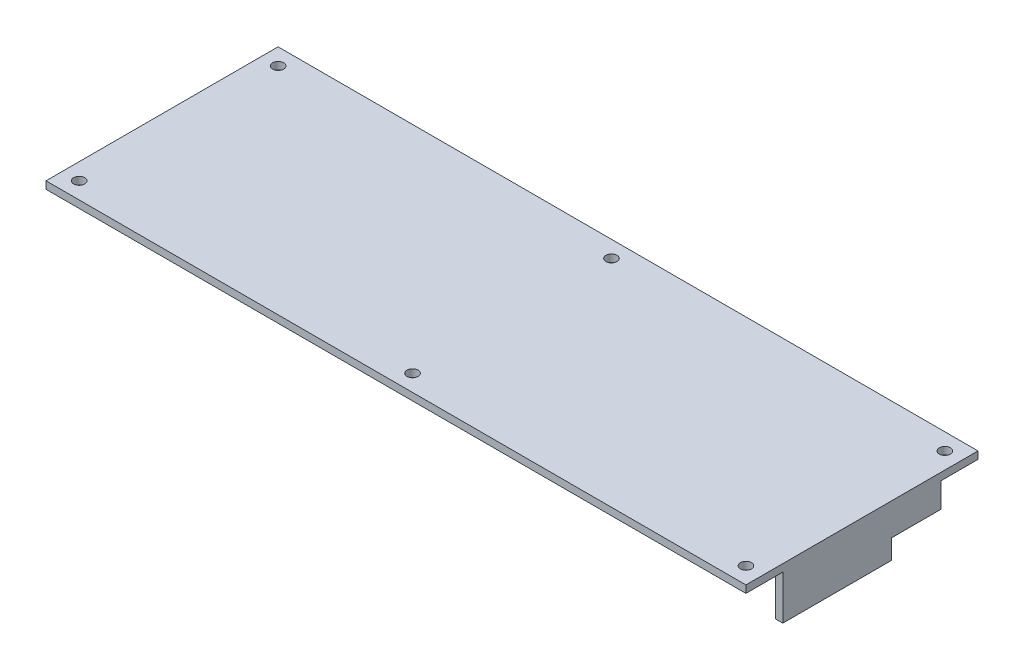
ISO-10303-21;
HEADER;
FILE_DESCRIPTION(('STEP AP214'),'2;1');
FILE_NAME('part.step','',(''),(''),'','','');
FILE_SCHEMA(('AUTOMOTIVE_DESIGN { 1 0 10303 214 1 1 1 1 }'));
ENDSEC;
DATA;
#1=APPLICATION_CONTEXT('core data for automotive mechanical design processes');
#2=APPLICATION_PROTOCOL_DEFINITION('international standard','automotive_design',2000,#1);
#3=PRODUCT_CONTEXT('',#1,'mechanical');
#4=PRODUCT('Part','Part','',(#3));
#5=PRODUCT_RELATED_PRODUCT_CATEGORY('part','',(#4));
#6=PRODUCT_DEFINITION_FORMATION('','',#4);
#7=PRODUCT_DEFINITION_CONTEXT('part definition',#1,'design');
#8=PRODUCT_DEFINITION('design','',#6,#7);
#9=PRODUCT_DEFINITION_SHAPE('','',#8);
#10=(LENGTH_UNIT() NAMED_UNIT(*) SI_UNIT(.MILLI.,.METRE.));
#11=(NAMED_UNIT(*) PLANE_ANGLE_UNIT() SI_UNIT($,.RADIAN.));
#12=(NAMED_UNIT(*) SI_UNIT($,.STERADIAN.) SOLID_ANGLE_UNIT());
#13=UNCERTAINTY_MEASURE_WITH_UNIT(LENGTH_MEASURE(1.E-05),#10,'distance_accuracy_value','');
#14=(GEOMETRIC_REPRESENTATION_CONTEXT(3) GLOBAL_UNCERTAINTY_ASSIGNED_CONTEXT((#13)) GLOBAL_UNIT_ASSIGNED_CONTEXT((#10,
#11,#12)) REPRESENTATION_CONTEXT('',''));
#15=CARTESIAN_POINT('',(0.,0.,0.));
#16=DIRECTION('',(0.,0.,1.));
#17=DIRECTION('',(1.,0.,0.));
#18=AXIS2_PLACEMENT_3D('',#15,#16,#17);
#19=CARTESIAN_POINT('',(0.,24.,0.));
#20=DIRECTION('',(0.,1.,0.));
#21=DIRECTION('',(0.,0.,1.));
#22=AXIS2_PLACEMENT_3D('',#19,#20,#21);
#23=PLANE('',#22);
#24=CARTESIAN_POINT('',(0.,24.,27.));
#25=DIRECTION('',(0.,1.,0.));
#26=DIRECTION('',(0.,0.,1.));
#27=AXIS2_PLACEMENT_3D('',#24,#25,#26);
#28=CIRCLE('',#27,1.5);
#29=CARTESIAN_POINT('',(0.,24.,28.5));
#30=VERTEX_POINT('',#29);
#31=EDGE_CURVE('E874',#30,#30,#28,.F.);
#32=ORIENTED_EDGE('',*,*,#31,.T.);
#33=EDGE_LOOP('',(#32));
#34=FACE_BOUND('',#33,.T.);
#35=CARTESIAN_POINT('',(90.5,24.,-27.));
#36=DIRECTION('',(0.,1.,0.));
#37=DIRECTION('',(0.,0.,1.));
#38=AXIS2_PLACEMENT_3D('',#35,#36,#37);
#39=CIRCLE('',#38,1.50000000000001);
#40=CARTESIAN_POINT('',(90.5,24.,-25.5));
#41=VERTEX_POINT('',#40);
#42=EDGE_CURVE('E876',#41,#41,#39,.F.);
#43=ORIENTED_EDGE('',*,*,#42,.T.);
#44=EDGE_LOOP('',(#43));
#45=FACE_BOUND('',#44,.T.);
#46=CARTESIAN_POINT('',(-90.5,24.,-26.9999999999999));
#47=DIRECTION('',(0.,1.,0.));
#48=DIRECTION('',(0.,0.,1.));
#49=AXIS2_PLACEMENT_3D('',#46,#47,#48);
#50=CIRCLE('',#49,1.50000000000003);
#51=CARTESIAN_POINT('',(-90.5,24.,-25.4999999999999));
#52=VERTEX_POINT('',#51);
#53=EDGE_CURVE('E887',#52,#52,#50,.T.);
#54=ORIENTED_EDGE('',*,*,#53,.F.);
#55=EDGE_LOOP('',(#54));
#56=FACE_BOUND('',#55,.T.);
#57=DIRECTION('',(0.,0.,1.));
#58=VECTOR('',#57,1.);
#59=CARTESIAN_POINT('',(95.,24.,0.));
#60=LINE('',#59,#58);
#61=CARTESIAN_POINT('',(95.,24.,-31.5));
#62=VERTEX_POINT('',#61);
#63=CARTESIAN_POINT('',(95.,24.,31.5));
#64=VERTEX_POINT('',#63);
#65=EDGE_CURVE('E432',#62,#64,#60,.T.);
#66=ORIENTED_EDGE('',*,*,#65,.F.);
#67=DIRECTION('',(1.,0.,0.));
#68=VECTOR('',#67,1.);
#69=CARTESIAN_POINT('',(0.,24.,-31.5));
#70=LINE('',#69,#68);
#71=CARTESIAN_POINT('',(-95.,24.,-31.5));
#72=VERTEX_POINT('',#71);
#73=EDGE_CURVE('E449',#72,#62,#70,.T.);
#74=ORIENTED_EDGE('',*,*,#73,.F.);
#75=DIRECTION('',(0.,0.,1.));
#76=VECTOR('',#75,1.);
#77=CARTESIAN_POINT('',(-95.,24.,0.));
#78=LINE('',#77,#76);
#79=CARTESIAN_POINT('',(-95.,24.,31.5));
#80=VERTEX_POINT('',#79);
#81=EDGE_CURVE('E453',#72,#80,#78,.T.);
#82=ORIENTED_EDGE('',*,*,#81,.T.);
#83=DIRECTION('',(1.,0.,0.));
#84=VECTOR('',#83,1.);
#85=CARTESIAN_POINT('',(0.,24.,31.5));
#86=LINE('',#85,#84);
#87=EDGE_CURVE('E457',#80,#64,#86,.T.);
#88=ORIENTED_EDGE('',*,*,#87,.T.);
#89=EDGE_LOOP('',(#66,#74,#82,#88));
#90=FACE_BOUND('',#89,.T.);
#91=CARTESIAN_POINT('',(-90.4999999999999,24.,27.));
#92=DIRECTION('',(0.,1.,0.));
#93=DIRECTION('',(0.,0.,1.));
#94=AXIS2_PLACEMENT_3D('',#91,#92,#93);
#95=CIRCLE('',#94,1.50000000000001);
#96=CARTESIAN_POINT('',(-90.4999999999999,24.,28.5));
#97=VERTEX_POINT('',#96);
#98=EDGE_CURVE('E316',#97,#97,#95,.F.);
#99=ORIENTED_EDGE('',*,*,#98,.T.);
#100=EDGE_LOOP('',(#99));
#101=FACE_BOUND('',#100,.T.);
#102=CARTESIAN_POINT('',(0.,24.,-27.));
#103=DIRECTION('',(0.,1.,0.));
#104=DIRECTION('',(0.,0.,1.));
#105=AXIS2_PLACEMENT_3D('',#102,#103,#104);
#106=CIRCLE('',#105,1.5);
#107=CARTESIAN_POINT('',(0.,24.,-25.5));
#108=VERTEX_POINT('',#107);
#109=EDGE_CURVE('E877',#108,#108,#106,.T.);
#110=ORIENTED_EDGE('',*,*,#109,.F.);
#111=EDGE_LOOP('',(#110));
#112=FACE_BOUND('',#111,.T.);
#113=CARTESIAN_POINT('',(90.4999999999999,24.,27.));
#114=DIRECTION('',(0.,1.,0.));
#115=DIRECTION('',(0.,0.,1.));
#116=AXIS2_PLACEMENT_3D('',#113,#114,#115);
#117=CIRCLE('',#116,1.50000000000001);
#118=CARTESIAN_POINT('',(90.4999999999999,24.,28.5));
#119=VERTEX_POINT('',#118);
#120=EDGE_CURVE('E882',#119,#119,#117,.T.);
#121=ORIENTED_EDGE('',*,*,#120,.F.);
#122=EDGE_LOOP('',(#121));
#123=FACE_BOUND('',#122,.T.);
#124=ADVANCED_FACE('F39',(#34,#45,#56,#90,#101,#112,#123),#23,.T.);
#125=CARTESIAN_POINT('',(0.,22.,0.));
#126=DIRECTION('',(0.,1.,0.));
#127=DIRECTION('',(0.,0.,1.));
#128=AXIS2_PLACEMENT_3D('',#125,#126,#127);
#129=PLANE('',#128);
#130=CARTESIAN_POINT('',(0.,22.,27.));
#131=DIRECTION('',(0.,1.,0.));
#132=DIRECTION('',(0.,0.,1.));
#133=AXIS2_PLACEMENT_3D('',#130,#131,#132);
#134=CIRCLE('',#133,1.5);
#135=CARTESIAN_POINT('',(0.,22.,28.5));
#136=VERTEX_POINT('',#135);
#137=EDGE_CURVE('E43',#136,#136,#134,.T.);
#138=ORIENTED_EDGE('',*,*,#137,.T.);
#139=EDGE_LOOP('',(#138));
#140=FACE_BOUND('',#139,.T.);
#141=CARTESIAN_POINT('',(90.5,22.,-27.));
#142=DIRECTION('',(0.,1.,0.));
#143=DIRECTION('',(0.,0.,1.));
#144=AXIS2_PLACEMENT_3D('',#141,#142,#143);
#145=CIRCLE('',#144,1.50000000000001);
#146=CARTESIAN_POINT('',(90.5,22.,-25.5));
#147=VERTEX_POINT('',#146);
#148=EDGE_CURVE('E327',#147,#147,#145,.T.);
#149=ORIENTED_EDGE('',*,*,#148,.T.);
#150=EDGE_LOOP('',(#149));
#151=FACE_BOUND('',#150,.T.);
#152=CARTESIAN_POINT('',(-90.4999999999999,22.,27.));
#153=DIRECTION('',(0.,1.,0.));
#154=DIRECTION('',(0.,0.,1.));
#155=AXIS2_PLACEMENT_3D('',#152,#153,#154);
#156=CIRCLE('',#155,1.50000000000001);
#157=CARTESIAN_POINT('',(-90.4999999999999,22.,28.5));
#158=VERTEX_POINT('',#157);
#159=EDGE_CURVE('E311',#158,#158,#156,.T.);
#160=ORIENTED_EDGE('',*,*,#159,.T.);
#161=EDGE_LOOP('',(#160));
#162=FACE_BOUND('',#161,.T.);
#163=DIRECTION('',(1.,0.,0.));
#164=VECTOR('',#163,1.);
#165=CARTESIAN_POINT('',(93.,22.,31.5));
#166=LINE('',#165,#164);
#167=CARTESIAN_POINT('',(-95.,22.,31.5));
#168=VERTEX_POINT('',#167);
#169=CARTESIAN_POINT('',(95.,22.,31.5));
#170=VERTEX_POINT('',#169);
#171=EDGE_CURVE('E440',#168,#170,#166,.T.);
#172=ORIENTED_EDGE('',*,*,#171,.F.);
#173=DIRECTION('',(0.,0.,-1.));
#174=VECTOR('',#173,1.);
#175=CARTESIAN_POINT('',(-95.,22.,31.5));
#176=LINE('',#175,#174);
#177=CARTESIAN_POINT('',(-95.,22.,15.5));
#178=VERTEX_POINT('',#177);
#179=EDGE_CURVE('E338',#168,#178,#176,.T.);
#180=ORIENTED_EDGE('',*,*,#179,.T.);
#181=DIRECTION('',(-1.,0.,0.));
#182=VECTOR('',#181,1.);
#183=CARTESIAN_POINT('',(-93.,22.,15.5));
#184=LINE('',#183,#182);
#185=CARTESIAN_POINT('',(-93.,22.,15.5));
#186=VERTEX_POINT('',#185);
#187=EDGE_CURVE('E347',#186,#178,#184,.T.);
#188=ORIENTED_EDGE('',*,*,#187,.F.);
#189=DIRECTION('',(0.,0.,1.));
#190=VECTOR('',#189,1.);
#191=CARTESIAN_POINT('',(-93.,22.,0.));
#192=LINE('',#191,#190);
#193=CARTESIAN_POINT('',(-93.,22.,-15.5));
#194=VERTEX_POINT('',#193);
#195=EDGE_CURVE('E285',#194,#186,#192,.T.);
#196=ORIENTED_EDGE('',*,*,#195,.F.);
#197=DIRECTION('',(-1.,0.,0.));
#198=VECTOR('',#197,1.);
#199=CARTESIAN_POINT('',(-93.,22.,-15.5));
#200=LINE('',#199,#198);
#201=CARTESIAN_POINT('',(-95.,22.,-15.5));
#202=VERTEX_POINT('',#201);
#203=EDGE_CURVE('E200',#194,#202,#200,.T.);
#204=ORIENTED_EDGE('',*,*,#203,.T.);
#205=DIRECTION('',(0.,0.,-1.));
#206=VECTOR('',#205,1.);
#207=CARTESIAN_POINT('',(-95.,22.,-29.5));
#208=LINE('',#207,#206);
#209=CARTESIAN_POINT('',(-95.,22.,-31.5));
#210=VERTEX_POINT('',#209);
#211=EDGE_CURVE('E371',#202,#210,#208,.T.);
#212=ORIENTED_EDGE('',*,*,#211,.T.);
#213=DIRECTION('',(1.,0.,0.));
#214=VECTOR('',#213,1.);
#215=CARTESIAN_POINT('',(-95.,22.,-31.5));
#216=LINE('',#215,#214);
#217=CARTESIAN_POINT('',(-68.,22.,-31.5));
#218=VERTEX_POINT('',#217);
#219=EDGE_CURVE('E351',#210,#218,#216,.T.);
#220=ORIENTED_EDGE('',*,*,#219,.T.);
#221=DIRECTION('',(0.,0.,-1.));
#222=VECTOR('',#221,1.);
#223=CARTESIAN_POINT('',(-68.,22.,-29.5));
#224=LINE('',#223,#222);
#225=CARTESIAN_POINT('',(-68.,22.,-29.5));
#226=VERTEX_POINT('',#225);
#227=EDGE_CURVE('E402',#226,#218,#224,.T.);
#228=ORIENTED_EDGE('',*,*,#227,.F.);
#229=DIRECTION('',(1.,0.,0.));
#230=VECTOR('',#229,1.);
#231=CARTESIAN_POINT('',(0.,22.,-29.5));
#232=LINE('',#231,#230);
#233=CARTESIAN_POINT('',(-35.,22.,-29.5));
#234=VERTEX_POINT('',#233);
#235=EDGE_CURVE('E288',#226,#234,#232,.T.);
#236=ORIENTED_EDGE('',*,*,#235,.T.);
#237=DIRECTION('',(0.,0.,-1.));
#238=VECTOR('',#237,1.);
#239=CARTESIAN_POINT('',(-35.,22.,-29.5));
#240=LINE('',#239,#238);
#241=CARTESIAN_POINT('',(-35.,22.,-31.5));
#242=VERTEX_POINT('',#241);
#243=EDGE_CURVE('E399',#234,#242,#240,.T.);
#244=ORIENTED_EDGE('',*,*,#243,.T.);
#245=DIRECTION('',(1.,0.,0.));
#246=VECTOR('',#245,1.);
#247=CARTESIAN_POINT('',(55.,22.,-31.5));
#248=LINE('',#247,#246);
#249=CARTESIAN_POINT('',(55.,22.,-31.5));
#250=VERTEX_POINT('',#249);
#251=EDGE_CURVE('E381',#242,#250,#248,.T.);
#252=ORIENTED_EDGE('',*,*,#251,.T.);
#253=DIRECTION('',(0.,0.,-1.));
#254=VECTOR('',#253,1.);
#255=CARTESIAN_POINT('',(55.,22.,-29.5));
#256=LINE('',#255,#254);
#257=CARTESIAN_POINT('',(55.,22.,-29.5));
#258=VERTEX_POINT('',#257);
#259=EDGE_CURVE('E396',#258,#250,#256,.T.);
#260=ORIENTED_EDGE('',*,*,#259,.F.);
#261=DIRECTION('',(-1.,0.,0.));
#262=VECTOR('',#261,1.);
#263=CARTESIAN_POINT('',(0.,22.,-29.5));
#264=LINE('',#263,#262);
#265=CARTESIAN_POINT('',(75.,22.,-29.5));
#266=VERTEX_POINT('',#265);
#267=EDGE_CURVE('E292',#266,#258,#264,.T.);
#268=ORIENTED_EDGE('',*,*,#267,.F.);
#269=DIRECTION('',(0.,0.,-1.));
#270=VECTOR('',#269,1.);
#271=CARTESIAN_POINT('',(75.,22.,-29.5));
#272=LINE('',#271,#270);
#273=CARTESIAN_POINT('',(75.,22.,-31.5));
#274=VERTEX_POINT('',#273);
#275=EDGE_CURVE('E391',#266,#274,#272,.T.);
#276=ORIENTED_EDGE('',*,*,#275,.T.);
#277=DIRECTION('',(1.,0.,0.));
#278=VECTOR('',#277,1.);
#279=CARTESIAN_POINT('',(93.,22.,-31.5));
#280=LINE('',#279,#278);
#281=CARTESIAN_POINT('',(95.,22.,-31.5));
#282=VERTEX_POINT('',#281);
#283=EDGE_CURVE('E437',#274,#282,#280,.T.);
#284=ORIENTED_EDGE('',*,*,#283,.T.);
#285=DIRECTION('',(0.,0.,1.));
#286=VECTOR('',#285,1.);
#287=CARTESIAN_POINT('',(95.,22.,-31.5));
#288=LINE('',#287,#286);
#289=CARTESIAN_POINT('',(95.,22.,-21.5));
#290=VERTEX_POINT('',#289);
#291=EDGE_CURVE('E424',#282,#290,#288,.T.);
#292=ORIENTED_EDGE('',*,*,#291,.T.);
#293=DIRECTION('',(1.,0.,0.));
#294=VECTOR('',#293,1.);
#295=CARTESIAN_POINT('',(93.,22.,-21.5));
#296=LINE('',#295,#294);
#297=CARTESIAN_POINT('',(93.,22.,-21.5));
#298=VERTEX_POINT('',#297);
#299=EDGE_CURVE('E433',#298,#290,#296,.T.);
#300=ORIENTED_EDGE('',*,*,#299,.F.);
#301=DIRECTION('',(0.,0.,-1.));
#302=VECTOR('',#301,1.);
#303=CARTESIAN_POINT('',(93.,22.,0.));
#304=LINE('',#303,#302);
#305=CARTESIAN_POINT('',(93.,22.,21.5));
#306=VERTEX_POINT('',#305);
#307=EDGE_CURVE('E281',#306,#298,#304,.T.);
#308=ORIENTED_EDGE('',*,*,#307,.F.);
#309=DIRECTION('',(1.,0.,0.));
#310=VECTOR('',#309,1.);
#311=CARTESIAN_POINT('',(93.,22.,21.5));
#312=LINE('',#311,#310);
#313=CARTESIAN_POINT('',(95.,22.,21.5));
#314=VERTEX_POINT('',#313);
#315=EDGE_CURVE('E417',#306,#314,#312,.T.);
#316=ORIENTED_EDGE('',*,*,#315,.T.);
#317=DIRECTION('',(0.,0.,1.));
#318=VECTOR('',#317,1.);
#319=CARTESIAN_POINT('',(95.,22.,21.5));
#320=LINE('',#319,#318);
#321=EDGE_CURVE('E421',#314,#170,#320,.T.);
#322=ORIENTED_EDGE('',*,*,#321,.T.);
#323=EDGE_LOOP('',(#172,#180,#188,#196,#204,#212,#220,#228,#236,#244,#252,#260,#268,#276,#284,
#292,#300,#308,#316,#322));
#324=FACE_BOUND('',#323,.T.);
#325=CARTESIAN_POINT('',(0.,22.,-27.));
#326=DIRECTION('',(0.,1.,0.));
#327=DIRECTION('',(0.,0.,1.));
#328=AXIS2_PLACEMENT_3D('',#325,#326,#327);
#329=CIRCLE('',#328,1.5);
#330=CARTESIAN_POINT('',(0.,22.,-25.5));
#331=VERTEX_POINT('',#330);
#332=EDGE_CURVE('E315',#331,#331,#329,.F.);
#333=ORIENTED_EDGE('',*,*,#332,.F.);
#334=EDGE_LOOP('',(#333));
#335=FACE_BOUND('',#334,.T.);
#336=CARTESIAN_POINT('',(-90.5,22.,-26.9999999999999));
#337=DIRECTION('',(0.,1.,0.));
#338=DIRECTION('',(0.,0.,1.));
#339=AXIS2_PLACEMENT_3D('',#336,#337,#338);
#340=CIRCLE('',#339,1.50000000000003);
#341=CARTESIAN_POINT('',(-90.5,22.,-25.4999999999999));
#342=VERTEX_POINT('',#341);
#343=EDGE_CURVE('E320',#342,#342,#340,.F.);
#344=ORIENTED_EDGE('',*,*,#343,.F.);
#345=EDGE_LOOP('',(#344));
#346=FACE_BOUND('',#345,.T.);
#347=CARTESIAN_POINT('',(90.4999999999999,22.,27.));
#348=DIRECTION('',(0.,1.,0.));
#349=DIRECTION('',(0.,0.,1.));
#350=AXIS2_PLACEMENT_3D('',#347,#348,#349);
#351=CIRCLE('',#350,1.50000000000001);
#352=CARTESIAN_POINT('',(90.4999999999999,22.,28.5));
#353=VERTEX_POINT('',#352);
#354=EDGE_CURVE('E324',#353,#353,#351,.F.);
#355=ORIENTED_EDGE('',*,*,#354,.F.);
#356=EDGE_LOOP('',(#355));
#357=FACE_BOUND('',#356,.T.);
#358=ADVANCED_FACE('F472',(#140,#151,#162,#324,#335,#346,#357),#129,.F.);
#359=CARTESIAN_POINT('',(0.,22.,-29.5));
#360=DIRECTION('',(0.,0.,-1.));
#361=DIRECTION('',(-1.,0.,0.));
#362=AXIS2_PLACEMENT_3D('',#359,#360,#361);
#363=PLANE('',#362);
#364=DIRECTION('',(-1.,0.,0.));
#365=VECTOR('',#364,1.);
#366=CARTESIAN_POINT('',(0.,14.,-29.5));
#367=LINE('',#366,#365);
#368=CARTESIAN_POINT('',(75.,14.,-29.5));
#369=VERTEX_POINT('',#368);
#370=CARTESIAN_POINT('',(55.,14.,-29.5));
#371=VERTEX_POINT('',#370);
#372=EDGE_CURVE('E11',#369,#371,#367,.T.);
#373=ORIENTED_EDGE('',*,*,#372,.F.);
#374=DIRECTION('',(0.,1.,0.));
#375=VECTOR('',#374,1.);
#376=CARTESIAN_POINT('',(75.,22.,-29.5));
#377=LINE('',#376,#375);
#378=EDGE_CURVE('E367',#369,#266,#377,.T.);
#379=ORIENTED_EDGE('',*,*,#378,.T.);
#380=ORIENTED_EDGE('',*,*,#267,.T.);
#381=DIRECTION('',(0.,-1.,0.));
#382=VECTOR('',#381,1.);
#383=CARTESIAN_POINT('',(55.,14.,-29.5));
#384=LINE('',#383,#382);
#385=EDGE_CURVE('E363',#258,#371,#384,.T.);
#386=ORIENTED_EDGE('',*,*,#385,.T.);
#387=EDGE_LOOP('',(#373,#379,#380,#386));
#388=FACE_BOUND('',#387,.T.);
#389=ADVANCED_FACE('F510',(#388),#363,.F.);
#390=CARTESIAN_POINT('',(92.,15.3,-8.));
#391=DIRECTION('',(0.,1.,0.));
#392=DIRECTION('',(0.,0.,1.));
#393=AXIS2_PLACEMENT_3D('',#390,#391,#392);
#394=PLANE('',#393);
#395=DIRECTION('',(0.,0.,-1.));
#396=VECTOR('',#395,1.);
#397=CARTESIAN_POINT('',(93.,15.3,0.));
#398=LINE('',#397,#396);
#399=CARTESIAN_POINT('',(93.,15.3,-8.));
#400=VERTEX_POINT('',#399);
#401=CARTESIAN_POINT('',(93.,15.3,-21.5));
#402=VERTEX_POINT('',#401);
#403=EDGE_CURVE('E259',#400,#402,#398,.T.);
#404=ORIENTED_EDGE('',*,*,#403,.T.);
#405=DIRECTION('',(1.,0.,0.));
#406=VECTOR('',#405,1.);
#407=CARTESIAN_POINT('',(92.,15.3,-21.5));
#408=LINE('',#407,#406);
#409=CARTESIAN_POINT('',(95.,15.3,-21.5));
#410=VERTEX_POINT('',#409);
#411=EDGE_CURVE('E267',#402,#410,#408,.T.);
#412=ORIENTED_EDGE('',*,*,#411,.T.);
#413=DIRECTION('',(0.,0.,1.));
#414=VECTOR('',#413,1.);
#415=CARTESIAN_POINT('',(95.,15.3,-8.));
#416=LINE('',#415,#414);
#417=CARTESIAN_POINT('',(95.,15.3,-8.));
#418=VERTEX_POINT('',#417);
#419=EDGE_CURVE('E263',#410,#418,#416,.T.);
#420=ORIENTED_EDGE('',*,*,#419,.T.);
#421=DIRECTION('',(1.,0.,0.));
#422=VECTOR('',#421,1.);
#423=CARTESIAN_POINT('',(92.,15.3,-8.));
#424=LINE('',#423,#422);
#425=EDGE_CURVE('E256',#400,#418,#424,.T.);
#426=ORIENTED_EDGE('',*,*,#425,.F.);
#427=EDGE_LOOP('',(#404,#412,#420,#426));
#428=FACE_BOUND('',#427,.T.);
#429=ADVANCED_FACE('F551',(#428),#394,.F.);
#430=CARTESIAN_POINT('',(92.,2.,-8.));
#431=DIRECTION('',(0.,0.,1.));
#432=DIRECTION('',(0.,-1.,0.));
#433=AXIS2_PLACEMENT_3D('',#430,#431,#432);
#434=PLANE('',#433);
#435=DIRECTION('',(0.,-1.,0.));
#436=VECTOR('',#435,1.);
#437=CARTESIAN_POINT('',(95.,2.,-8.));
#438=LINE('',#437,#436);
#439=CARTESIAN_POINT('',(95.,10.,-8.));
#440=VERTEX_POINT('',#439);
#441=EDGE_CURVE('E252',#418,#440,#438,.T.);
#442=ORIENTED_EDGE('',*,*,#441,.T.);
#443=DIRECTION('',(1.,0.,0.));
#444=VECTOR('',#443,1.);
#445=CARTESIAN_POINT('',(93.,10.,-8.));
#446=LINE('',#445,#444);
#447=CARTESIAN_POINT('',(93.,10.,-8.));
#448=VERTEX_POINT('',#447);
#449=EDGE_CURVE('E429',#448,#440,#446,.T.);
#450=ORIENTED_EDGE('',*,*,#449,.F.);
#451=DIRECTION('',(0.,1.,0.));
#452=VECTOR('',#451,1.);
#453=CARTESIAN_POINT('',(93.,22.,-7.99999999999999));
#454=LINE('',#453,#452);
#455=EDGE_CURVE('E65',#448,#400,#454,.T.);
#456=ORIENTED_EDGE('',*,*,#455,.T.);
#457=ORIENTED_EDGE('',*,*,#425,.T.);
#458=EDGE_LOOP('',(#442,#450,#456,#457));
#459=FACE_BOUND('',#458,.T.);
#460=ADVANCED_FACE('F549',(#459),#434,.F.);
#461=CARTESIAN_POINT('',(92.,10.,21.5));
#462=DIRECTION('',(0.,1.,0.));
#463=DIRECTION('',(0.,0.,1.));
#464=AXIS2_PLACEMENT_3D('',#461,#462,#463);
#465=PLANE('',#464);
#466=DIRECTION('',(0.,0.,-1.));
#467=VECTOR('',#466,1.);
#468=CARTESIAN_POINT('',(93.,10.,0.));
#469=LINE('',#468,#467);
#470=CARTESIAN_POINT('',(93.,10.,21.5));
#471=VERTEX_POINT('',#470);
#472=EDGE_CURVE('E278',#471,#448,#469,.T.);
#473=ORIENTED_EDGE('',*,*,#472,.T.);
#474=ORIENTED_EDGE('',*,*,#449,.T.);
#475=DIRECTION('',(0.,0.,1.));
#476=VECTOR('',#475,1.);
#477=CARTESIAN_POINT('',(95.,10.,21.5));
#478=LINE('',#477,#476);
#479=CARTESIAN_POINT('',(95.,10.,21.5));
#480=VERTEX_POINT('',#479);
#481=EDGE_CURVE('E57',#440,#480,#478,.T.);
#482=ORIENTED_EDGE('',*,*,#481,.T.);
#483=DIRECTION('',(1.,0.,0.));
#484=VECTOR('',#483,1.);
#485=CARTESIAN_POINT('',(92.,10.,21.5));
#486=LINE('',#485,#484);
#487=EDGE_CURVE('E255',#471,#480,#486,.T.);
#488=ORIENTED_EDGE('',*,*,#487,.F.);
#489=EDGE_LOOP('',(#473,#474,#482,#488));
#490=FACE_BOUND('',#489,.T.);
#491=ADVANCED_FACE('F545',(#490),#465,.F.);
#492=CARTESIAN_POINT('',(-35.,14.,-28.5));
#493=DIRECTION('',(0.,1.,0.));
#494=DIRECTION('',(0.,0.,1.));
#495=AXIS2_PLACEMENT_3D('',#492,#493,#494);
#496=PLANE('',#495);
#497=DIRECTION('',(0.,0.,-1.));
#498=VECTOR('',#497,1.);
#499=CARTESIAN_POINT('',(-68.,14.,-28.5));
#500=LINE('',#499,#498);
#501=CARTESIAN_POINT('',(-68.,14.,-29.5));
#502=VERTEX_POINT('',#501);
#503=CARTESIAN_POINT('',(-68.,14.,-31.5));
#504=VERTEX_POINT('',#503);
#505=EDGE_CURVE('E226',#502,#504,#500,.T.);
#506=ORIENTED_EDGE('',*,*,#505,.T.);
#507=DIRECTION('',(1.,0.,0.));
#508=VECTOR('',#507,1.);
#509=CARTESIAN_POINT('',(-35.,14.,-31.5));
#510=LINE('',#509,#508);
#511=CARTESIAN_POINT('',(-35.,14.,-31.5));
#512=VERTEX_POINT('',#511);
#513=EDGE_CURVE('E222',#504,#512,#510,.T.);
#514=ORIENTED_EDGE('',*,*,#513,.T.);
#515=DIRECTION('',(0.,0.,-1.));
#516=VECTOR('',#515,1.);
#517=CARTESIAN_POINT('',(-35.,14.,-28.5));
#518=LINE('',#517,#516);
#519=CARTESIAN_POINT('',(-35.,14.,-29.5));
#520=VERTEX_POINT('',#519);
#521=EDGE_CURVE('E236',#520,#512,#518,.T.);
#522=ORIENTED_EDGE('',*,*,#521,.F.);
#523=DIRECTION('',(1.,0.,0.));
#524=VECTOR('',#523,1.);
#525=CARTESIAN_POINT('',(0.,14.,-29.5));
#526=LINE('',#525,#524);
#527=EDGE_CURVE('E240',#502,#520,#526,.T.);
#528=ORIENTED_EDGE('',*,*,#527,.F.);
#529=EDGE_LOOP('',(#506,#514,#522,#528));
#530=FACE_BOUND('',#529,.T.);
#531=ADVANCED_FACE('F542',(#530),#496,.F.);
#532=CARTESIAN_POINT('',(75.,14.,-28.5));
#533=DIRECTION('',(0.,1.,0.));
#534=DIRECTION('',(0.,0.,1.));
#535=AXIS2_PLACEMENT_3D('',#532,#533,#534);
#536=PLANE('',#535);
#537=ORIENTED_EDGE('',*,*,#372,.T.);
#538=DIRECTION('',(0.,0.,-1.));
#539=VECTOR('',#538,1.);
#540=CARTESIAN_POINT('',(55.,14.,-28.5));
#541=LINE('',#540,#539);
#542=CARTESIAN_POINT('',(55.,14.,-31.5));
#543=VERTEX_POINT('',#542);
#544=EDGE_CURVE('E235',#371,#543,#541,.T.);
#545=ORIENTED_EDGE('',*,*,#544,.T.);
#546=DIRECTION('',(1.,0.,0.));
#547=VECTOR('',#546,1.);
#548=CARTESIAN_POINT('',(75.,14.,-31.5));
#549=LINE('',#548,#547);
#550=CARTESIAN_POINT('',(75.,14.,-31.5));
#551=VERTEX_POINT('',#550);
#552=EDGE_CURVE('E231',#543,#551,#549,.T.);
#553=ORIENTED_EDGE('',*,*,#552,.T.);
#554=DIRECTION('',(0.,0.,-1.));
#555=VECTOR('',#554,1.);
#556=CARTESIAN_POINT('',(75.,14.,-28.5));
#557=LINE('',#556,#555);
#558=EDGE_CURVE('E237',#369,#551,#557,.T.);
#559=ORIENTED_EDGE('',*,*,#558,.F.);
#560=EDGE_LOOP('',(#537,#545,#553,#559));
#561=FACE_BOUND('',#560,.T.);
#562=ADVANCED_FACE('F506',(#561),#536,.F.);
#563=CARTESIAN_POINT('',(-92.,9.5,-15.5));
#564=DIRECTION('',(0.,1.,0.));
#565=DIRECTION('',(0.,0.,1.));
#566=AXIS2_PLACEMENT_3D('',#563,#564,#565);
#567=PLANE('',#566);
#568=DIRECTION('',(0.,0.,1.));
#569=VECTOR('',#568,1.);
#570=CARTESIAN_POINT('',(-93.,9.5,0.));
#571=LINE('',#570,#569);
#572=CARTESIAN_POINT('',(-93.,9.5,-15.5));
#573=VERTEX_POINT('',#572);
#574=CARTESIAN_POINT('',(-93.,9.5,15.5));
#575=VERTEX_POINT('',#574);
#576=EDGE_CURVE('E213',#573,#575,#571,.T.);
#577=ORIENTED_EDGE('',*,*,#576,.T.);
#578=DIRECTION('',(-1.,0.,0.));
#579=VECTOR('',#578,1.);
#580=CARTESIAN_POINT('',(-92.,9.5,15.5));
#581=LINE('',#580,#579);
#582=CARTESIAN_POINT('',(-95.,9.5,15.5));
#583=VERTEX_POINT('',#582);
#584=EDGE_CURVE('E230',#575,#583,#581,.T.);
#585=ORIENTED_EDGE('',*,*,#584,.T.);
#586=DIRECTION('',(0.,0.,-1.));
#587=VECTOR('',#586,1.);
#588=CARTESIAN_POINT('',(-95.,9.5,-15.5));
#589=LINE('',#588,#587);
#590=CARTESIAN_POINT('',(-95.,9.5,-15.5));
#591=VERTEX_POINT('',#590);
#592=EDGE_CURVE('E215',#583,#591,#589,.T.);
#593=ORIENTED_EDGE('',*,*,#592,.T.);
#594=DIRECTION('',(-1.,0.,0.));
#595=VECTOR('',#594,1.);
#596=CARTESIAN_POINT('',(-92.,9.5,-15.5));
#597=LINE('',#596,#595);
#598=EDGE_CURVE('E197',#573,#591,#597,.T.);
#599=ORIENTED_EDGE('',*,*,#598,.F.);
#600=EDGE_LOOP('',(#577,#585,#593,#599));
#601=FACE_BOUND('',#600,.T.);
#602=ADVANCED_FACE('F211',(#601),#567,.F.);
#603=ORIENTED_EDGE('',*,*,#527,.T.);
#604=DIRECTION('',(0.,1.,0.));
#605=VECTOR('',#604,1.);
#606=CARTESIAN_POINT('',(-35.,14.,-29.5));
#607=LINE('',#606,#605);
#608=EDGE_CURVE('E358',#520,#234,#607,.T.);
#609=ORIENTED_EDGE('',*,*,#608,.T.);
#610=ORIENTED_EDGE('',*,*,#235,.F.);
#611=DIRECTION('',(0.,-1.,0.));
#612=VECTOR('',#611,1.);
#613=CARTESIAN_POINT('',(-68.,14.,-29.5));
#614=LINE('',#613,#612);
#615=EDGE_CURVE('E354',#226,#502,#614,.T.);
#616=ORIENTED_EDGE('',*,*,#615,.T.);
#617=EDGE_LOOP('',(#603,#609,#610,#616));
#618=FACE_BOUND('',#617,.T.);
#619=ADVANCED_FACE('F493',(#618),#363,.F.);
#620=CARTESIAN_POINT('',(-93.,22.,0.));
#621=DIRECTION('',(1.,0.,0.));
#622=DIRECTION('',(0.,0.,-1.));
#623=AXIS2_PLACEMENT_3D('',#620,#621,#622);
#624=PLANE('',#623);
#625=DIRECTION('',(0.,-1.,0.));
#626=VECTOR('',#625,1.);
#627=CARTESIAN_POINT('',(-93.,9.5,15.5));
#628=LINE('',#627,#626);
#629=EDGE_CURVE('E206',#186,#575,#628,.T.);
#630=ORIENTED_EDGE('',*,*,#629,.T.);
#631=ORIENTED_EDGE('',*,*,#576,.F.);
#632=DIRECTION('',(0.,1.,0.));
#633=VECTOR('',#632,1.);
#634=CARTESIAN_POINT('',(-93.,9.5,-15.5));
#635=LINE('',#634,#633);
#636=EDGE_CURVE('E193',#573,#194,#635,.T.);
#637=ORIENTED_EDGE('',*,*,#636,.T.);
#638=ORIENTED_EDGE('',*,*,#195,.T.);
#639=EDGE_LOOP('',(#630,#631,#637,#638));
#640=FACE_BOUND('',#639,.T.);
#641=ADVANCED_FACE('F219',(#640),#624,.T.);
#642=CARTESIAN_POINT('',(93.,22.,0.));
#643=DIRECTION('',(-1.,0.,0.));
#644=DIRECTION('',(0.,0.,1.));
#645=AXIS2_PLACEMENT_3D('',#642,#643,#644);
#646=PLANE('',#645);
#647=ORIENTED_EDGE('',*,*,#455,.F.);
#648=ORIENTED_EDGE('',*,*,#472,.F.);
#649=DIRECTION('',(0.,1.,0.));
#650=VECTOR('',#649,1.);
#651=CARTESIAN_POINT('',(93.,10.,21.5));
#652=LINE('',#651,#650);
#653=EDGE_CURVE('E408',#471,#306,#652,.T.);
#654=ORIENTED_EDGE('',*,*,#653,.T.);
#655=ORIENTED_EDGE('',*,*,#307,.T.);
#656=DIRECTION('',(0.,-1.,0.));
#657=VECTOR('',#656,1.);
#658=CARTESIAN_POINT('',(93.,15.3,-21.5));
#659=LINE('',#658,#657);
#660=EDGE_CURVE('E412',#298,#402,#659,.T.);
#661=ORIENTED_EDGE('',*,*,#660,.T.);
#662=ORIENTED_EDGE('',*,*,#403,.F.);
#663=EDGE_LOOP('',(#647,#648,#654,#655,#661,#662));
#664=FACE_BOUND('',#663,.T.);
#665=ADVANCED_FACE('F561',(#664),#646,.T.);
#666=CARTESIAN_POINT('',(0.,22.,31.5));
#667=DIRECTION('',(0.,0.,-1.));
#668=DIRECTION('',(-1.,0.,0.));
#669=AXIS2_PLACEMENT_3D('',#666,#667,#668);
#670=PLANE('',#669);
#671=DIRECTION('',(0.,-1.,0.));
#672=VECTOR('',#671,1.);
#673=CARTESIAN_POINT('',(-95.,22.,31.5));
#674=LINE('',#673,#672);
#675=EDGE_CURVE('E296',#80,#168,#674,.T.);
#676=ORIENTED_EDGE('',*,*,#675,.T.);
#677=ORIENTED_EDGE('',*,*,#171,.T.);
#678=DIRECTION('',(0.,-1.,0.));
#679=VECTOR('',#678,1.);
#680=CARTESIAN_POINT('',(95.,22.,31.5));
#681=LINE('',#680,#679);
#682=EDGE_CURVE('E49',#64,#170,#681,.T.);
#683=ORIENTED_EDGE('',*,*,#682,.F.);
#684=ORIENTED_EDGE('',*,*,#87,.F.);
#685=EDGE_LOOP('',(#676,#677,#683,#684));
#686=FACE_BOUND('',#685,.T.);
#687=ADVANCED_FACE('F41',(#686),#670,.F.);
#688=CARTESIAN_POINT('',(-95.,22.,0.));
#689=DIRECTION('',(-1.,0.,0.));
#690=DIRECTION('',(0.,0.,1.));
#691=AXIS2_PLACEMENT_3D('',#688,#689,#690);
#692=PLANE('',#691);
#693=ORIENTED_EDGE('',*,*,#592,.F.);
#694=DIRECTION('',(0.,-1.,0.));
#695=VECTOR('',#694,1.);
#696=CARTESIAN_POINT('',(-95.,9.5,15.5));
#697=LINE('',#696,#695);
#698=EDGE_CURVE('E207',#178,#583,#697,.T.);
#699=ORIENTED_EDGE('',*,*,#698,.F.);
#700=ORIENTED_EDGE('',*,*,#179,.F.);
#701=ORIENTED_EDGE('',*,*,#675,.F.);
#702=ORIENTED_EDGE('',*,*,#81,.F.);
#703=DIRECTION('',(0.,-1.,0.));
#704=VECTOR('',#703,1.);
#705=CARTESIAN_POINT('',(-95.,22.,-31.5));
#706=LINE('',#705,#704);
#707=EDGE_CURVE('E300',#72,#210,#706,.T.);
#708=ORIENTED_EDGE('',*,*,#707,.T.);
#709=ORIENTED_EDGE('',*,*,#211,.F.);
#710=DIRECTION('',(0.,1.,0.));
#711=VECTOR('',#710,1.);
#712=CARTESIAN_POINT('',(-95.,9.5,-15.5));
#713=LINE('',#712,#711);
#714=EDGE_CURVE('E334',#591,#202,#713,.T.);
#715=ORIENTED_EDGE('',*,*,#714,.F.);
#716=EDGE_LOOP('',(#693,#699,#700,#701,#702,#708,#709,#715));
#717=FACE_BOUND('',#716,.T.);
#718=ADVANCED_FACE('F468',(#717),#692,.T.);
#719=CARTESIAN_POINT('',(0.,22.,-31.5));
#720=DIRECTION('',(0.,0.,-1.));
#721=DIRECTION('',(-1.,0.,0.));
#722=AXIS2_PLACEMENT_3D('',#719,#720,#721);
#723=PLANE('',#722);
#724=ORIENTED_EDGE('',*,*,#283,.F.);
#725=DIRECTION('',(0.,1.,0.));
#726=VECTOR('',#725,1.);
#727=CARTESIAN_POINT('',(75.,22.,-31.5));
#728=LINE('',#727,#726);
#729=EDGE_CURVE('E359',#551,#274,#728,.T.);
#730=ORIENTED_EDGE('',*,*,#729,.F.);
#731=ORIENTED_EDGE('',*,*,#552,.F.);
#732=DIRECTION('',(0.,-1.,0.));
#733=VECTOR('',#732,1.);
#734=CARTESIAN_POINT('',(55.,14.,-31.5));
#735=LINE('',#734,#733);
#736=EDGE_CURVE('E385',#250,#543,#735,.T.);
#737=ORIENTED_EDGE('',*,*,#736,.F.);
#738=ORIENTED_EDGE('',*,*,#251,.F.);
#739=DIRECTION('',(0.,1.,0.));
#740=VECTOR('',#739,1.);
#741=CARTESIAN_POINT('',(-35.,14.,-31.5));
#742=LINE('',#741,#740);
#743=EDGE_CURVE('E377',#512,#242,#742,.T.);
#744=ORIENTED_EDGE('',*,*,#743,.F.);
#745=ORIENTED_EDGE('',*,*,#513,.F.);
#746=DIRECTION('',(0.,-1.,0.));
#747=VECTOR('',#746,1.);
#748=CARTESIAN_POINT('',(-68.,14.,-31.5));
#749=LINE('',#748,#747);
#750=EDGE_CURVE('E374',#218,#504,#749,.T.);
#751=ORIENTED_EDGE('',*,*,#750,.F.);
#752=ORIENTED_EDGE('',*,*,#219,.F.);
#753=ORIENTED_EDGE('',*,*,#707,.F.);
#754=ORIENTED_EDGE('',*,*,#73,.T.);
#755=DIRECTION('',(0.,-1.,0.));
#756=VECTOR('',#755,1.);
#757=CARTESIAN_POINT('',(95.,22.,-31.5));
#758=LINE('',#757,#756);
#759=EDGE_CURVE('E304',#62,#282,#758,.T.);
#760=ORIENTED_EDGE('',*,*,#759,.T.);
#761=EDGE_LOOP('',(#724,#730,#731,#737,#738,#744,#745,#751,#752,#753,#754,#760));
#762=FACE_BOUND('',#761,.T.);
#763=ADVANCED_FACE('F484',(#762),#723,.T.);
#764=CARTESIAN_POINT('',(95.,22.,0.));
#765=DIRECTION('',(-1.,0.,0.));
#766=DIRECTION('',(0.,0.,1.));
#767=AXIS2_PLACEMENT_3D('',#764,#765,#766);
#768=PLANE('',#767);
#769=ORIENTED_EDGE('',*,*,#481,.F.);
#770=ORIENTED_EDGE('',*,*,#441,.F.);
#771=ORIENTED_EDGE('',*,*,#419,.F.);
#772=DIRECTION('',(0.,-1.,0.));
#773=VECTOR('',#772,1.);
#774=CARTESIAN_POINT('',(95.,15.3,-21.5));
#775=LINE('',#774,#773);
#776=EDGE_CURVE('E413',#290,#410,#775,.T.);
#777=ORIENTED_EDGE('',*,*,#776,.F.);
#778=ORIENTED_EDGE('',*,*,#291,.F.);
#779=ORIENTED_EDGE('',*,*,#759,.F.);
#780=ORIENTED_EDGE('',*,*,#65,.T.);
#781=ORIENTED_EDGE('',*,*,#682,.T.);
#782=ORIENTED_EDGE('',*,*,#321,.F.);
#783=DIRECTION('',(0.,1.,0.));
#784=VECTOR('',#783,1.);
#785=CARTESIAN_POINT('',(95.,10.,21.5));
#786=LINE('',#785,#784);
#787=EDGE_CURVE('E395',#480,#314,#786,.T.);
#788=ORIENTED_EDGE('',*,*,#787,.F.);
#789=EDGE_LOOP('',(#769,#770,#771,#777,#778,#779,#780,#781,#782,#788));
#790=FACE_BOUND('',#789,.T.);
#791=ADVANCED_FACE('F477',(#790),#768,.F.);
#792=CARTESIAN_POINT('',(93.,15.3,-21.5));
#793=DIRECTION('',(0.,0.,1.));
#794=DIRECTION('',(1.,0.,0.));
#795=AXIS2_PLACEMENT_3D('',#792,#793,#794);
#796=PLANE('',#795);
#797=ORIENTED_EDGE('',*,*,#776,.T.);
#798=ORIENTED_EDGE('',*,*,#411,.F.);
#799=ORIENTED_EDGE('',*,*,#660,.F.);
#800=ORIENTED_EDGE('',*,*,#299,.T.);
#801=EDGE_LOOP('',(#797,#798,#799,#800));
#802=FACE_BOUND('',#801,.T.);
#803=ADVANCED_FACE('F522',(#802),#796,.F.);
#804=CARTESIAN_POINT('',(93.,10.,21.5));
#805=DIRECTION('',(0.,0.,-1.));
#806=DIRECTION('',(-1.,0.,0.));
#807=AXIS2_PLACEMENT_3D('',#804,#805,#806);
#808=PLANE('',#807);
#809=ORIENTED_EDGE('',*,*,#787,.T.);
#810=ORIENTED_EDGE('',*,*,#315,.F.);
#811=ORIENTED_EDGE('',*,*,#653,.F.);
#812=ORIENTED_EDGE('',*,*,#487,.T.);
#813=EDGE_LOOP('',(#809,#810,#811,#812));
#814=FACE_BOUND('',#813,.T.);
#815=ADVANCED_FACE('F515',(#814),#808,.F.);
#816=CARTESIAN_POINT('',(75.,22.,-29.5));
#817=DIRECTION('',(-1.,0.,0.));
#818=DIRECTION('',(0.,-1.,0.));
#819=AXIS2_PLACEMENT_3D('',#816,#817,#818);
#820=PLANE('',#819);
#821=ORIENTED_EDGE('',*,*,#729,.T.);
#822=ORIENTED_EDGE('',*,*,#275,.F.);
#823=ORIENTED_EDGE('',*,*,#378,.F.);
#824=ORIENTED_EDGE('',*,*,#558,.T.);
#825=EDGE_LOOP('',(#821,#822,#823,#824));
#826=FACE_BOUND('',#825,.T.);
#827=ADVANCED_FACE('F513',(#826),#820,.F.);
#828=CARTESIAN_POINT('',(-68.,14.,-29.5));
#829=DIRECTION('',(1.,0.,0.));
#830=DIRECTION('',(0.,0.,-1.));
#831=AXIS2_PLACEMENT_3D('',#828,#829,#830);
#832=PLANE('',#831);
#833=ORIENTED_EDGE('',*,*,#750,.T.);
#834=ORIENTED_EDGE('',*,*,#505,.F.);
#835=ORIENTED_EDGE('',*,*,#615,.F.);
#836=ORIENTED_EDGE('',*,*,#227,.T.);
#837=EDGE_LOOP('',(#833,#834,#835,#836));
#838=FACE_BOUND('',#837,.T.);
#839=ADVANCED_FACE('F489',(#838),#832,.F.);
#840=CARTESIAN_POINT('',(55.,14.,-29.5));
#841=DIRECTION('',(1.,0.,0.));
#842=DIRECTION('',(0.,0.,-1.));
#843=AXIS2_PLACEMENT_3D('',#840,#841,#842);
#844=PLANE('',#843);
#845=ORIENTED_EDGE('',*,*,#736,.T.);
#846=ORIENTED_EDGE('',*,*,#544,.F.);
#847=ORIENTED_EDGE('',*,*,#385,.F.);
#848=ORIENTED_EDGE('',*,*,#259,.T.);
#849=EDGE_LOOP('',(#845,#846,#847,#848));
#850=FACE_BOUND('',#849,.T.);
#851=ADVANCED_FACE('F503',(#850),#844,.F.);
#852=CARTESIAN_POINT('',(-35.,14.,-29.5));
#853=DIRECTION('',(-1.,0.,0.));
#854=DIRECTION('',(0.,0.,1.));
#855=AXIS2_PLACEMENT_3D('',#852,#853,#854);
#856=PLANE('',#855);
#857=ORIENTED_EDGE('',*,*,#743,.T.);
#858=ORIENTED_EDGE('',*,*,#243,.F.);
#859=ORIENTED_EDGE('',*,*,#608,.F.);
#860=ORIENTED_EDGE('',*,*,#521,.T.);
#861=EDGE_LOOP('',(#857,#858,#859,#860));
#862=FACE_BOUND('',#861,.T.);
#863=ADVANCED_FACE('F498',(#862),#856,.F.);
#864=CARTESIAN_POINT('',(-93.,9.5,-15.5));
#865=DIRECTION('',(0.,0.,1.));
#866=DIRECTION('',(1.,0.,0.));
#867=AXIS2_PLACEMENT_3D('',#864,#865,#866);
#868=PLANE('',#867);
#869=ORIENTED_EDGE('',*,*,#714,.T.);
#870=ORIENTED_EDGE('',*,*,#203,.F.);
#871=ORIENTED_EDGE('',*,*,#636,.F.);
#872=ORIENTED_EDGE('',*,*,#598,.T.);
#873=EDGE_LOOP('',(#869,#870,#871,#872));
#874=FACE_BOUND('',#873,.T.);
#875=ADVANCED_FACE('F196',(#874),#868,.F.);
#876=CARTESIAN_POINT('',(-93.,9.5,15.5));
#877=DIRECTION('',(0.,0.,-1.));
#878=DIRECTION('',(-1.,0.,0.));
#879=AXIS2_PLACEMENT_3D('',#876,#877,#878);
#880=PLANE('',#879);
#881=ORIENTED_EDGE('',*,*,#698,.T.);
#882=ORIENTED_EDGE('',*,*,#584,.F.);
#883=ORIENTED_EDGE('',*,*,#629,.F.);
#884=ORIENTED_EDGE('',*,*,#187,.T.);
#885=EDGE_LOOP('',(#881,#882,#883,#884));
#886=FACE_BOUND('',#885,.T.);
#887=ADVANCED_FACE('F464',(#886),#880,.F.);
#888=CARTESIAN_POINT('',(-90.4999999999999,24.,27.));
#889=DIRECTION('',(0.,-1.,0.));
#890=DIRECTION('',(0.,0.,-1.));
#891=AXIS2_PLACEMENT_3D('',#888,#889,#890);
#892=CYLINDRICAL_SURFACE('',#891,1.50000000000001);
#893=ORIENTED_EDGE('',*,*,#98,.F.);
#894=EDGE_LOOP('',(#893));
#895=FACE_BOUND('',#894,.T.);
#896=ORIENTED_EDGE('',*,*,#159,.F.);
#897=EDGE_LOOP('',(#896));
#898=FACE_BOUND('',#897,.T.);
#899=ADVANCED_FACE('F599',(#895,#898),#892,.F.);
#900=CARTESIAN_POINT('',(0.,24.,-27.));
#901=DIRECTION('',(0.,-1.,0.));
#902=DIRECTION('',(0.,0.,-1.));
#903=AXIS2_PLACEMENT_3D('',#900,#901,#902);
#904=CYLINDRICAL_SURFACE('',#903,1.5);
#905=ORIENTED_EDGE('',*,*,#109,.T.);
#906=EDGE_LOOP('',(#905));
#907=FACE_BOUND('',#906,.T.);
#908=ORIENTED_EDGE('',*,*,#332,.T.);
#909=EDGE_LOOP('',(#908));
#910=FACE_BOUND('',#909,.T.);
#911=ADVANCED_FACE('F607',(#907,#910),#904,.F.);
#912=CARTESIAN_POINT('',(-90.5,24.,-26.9999999999999));
#913=DIRECTION('',(0.,-1.,0.));
#914=DIRECTION('',(0.,0.,-1.));
#915=AXIS2_PLACEMENT_3D('',#912,#913,#914);
#916=CYLINDRICAL_SURFACE('',#915,1.50000000000003);
#917=ORIENTED_EDGE('',*,*,#53,.T.);
#918=EDGE_LOOP('',(#917));
#919=FACE_BOUND('',#918,.T.);
#920=ORIENTED_EDGE('',*,*,#343,.T.);
#921=EDGE_LOOP('',(#920));
#922=FACE_BOUND('',#921,.T.);
#923=ADVANCED_FACE('F616',(#919,#922),#916,.F.);
#924=CARTESIAN_POINT('',(90.4999999999999,24.,27.));
#925=DIRECTION('',(0.,-1.,0.));
#926=DIRECTION('',(0.,0.,-1.));
#927=AXIS2_PLACEMENT_3D('',#924,#925,#926);
#928=CYLINDRICAL_SURFACE('',#927,1.50000000000001);
#929=ORIENTED_EDGE('',*,*,#120,.T.);
#930=EDGE_LOOP('',(#929));
#931=FACE_BOUND('',#930,.T.);
#932=ORIENTED_EDGE('',*,*,#354,.T.);
#933=EDGE_LOOP('',(#932));
#934=FACE_BOUND('',#933,.T.);
#935=ADVANCED_FACE('F624',(#931,#934),#928,.F.);
#936=CARTESIAN_POINT('',(90.5,24.,-27.));
#937=DIRECTION('',(0.,-1.,0.));
#938=DIRECTION('',(0.,0.,-1.));
#939=AXIS2_PLACEMENT_3D('',#936,#937,#938);
#940=CYLINDRICAL_SURFACE('',#939,1.50000000000001);
#941=ORIENTED_EDGE('',*,*,#42,.F.);
#942=EDGE_LOOP('',(#941));
#943=FACE_BOUND('',#942,.T.);
#944=ORIENTED_EDGE('',*,*,#148,.F.);
#945=EDGE_LOOP('',(#944));
#946=FACE_BOUND('',#945,.T.);
#947=ADVANCED_FACE('F632',(#943,#946),#940,.F.);
#948=CARTESIAN_POINT('',(0.,24.,27.));
#949=DIRECTION('',(0.,-1.,0.));
#950=DIRECTION('',(0.,0.,-1.));
#951=AXIS2_PLACEMENT_3D('',#948,#949,#950);
#952=CYLINDRICAL_SURFACE('',#951,1.5);
#953=ORIENTED_EDGE('',*,*,#31,.F.);
#954=EDGE_LOOP('',(#953));
#955=FACE_BOUND('',#954,.T.);
#956=ORIENTED_EDGE('',*,*,#137,.F.);
#957=EDGE_LOOP('',(#956));
#958=FACE_BOUND('',#957,.T.);
#959=ADVANCED_FACE('F640',(#955,#958),#952,.F.);
#960=CLOSED_SHELL('',(#124,#358,#389,#429,#460,#491,#531,#562,#602,#619,#641,#665,#687,#718,
#763,#791,#803,#815,#827,#839,#851,#863,#875,#887,#899,#911,#923,#935,#947,#959));
#961=MANIFOLD_SOLID_BREP('B2',#960);
#962=ADVANCED_BREP_SHAPE_REPRESENTATION('',(#18,#961),#14);
#963=SHAPE_DEFINITION_REPRESENTATION(#9,#962);
ENDSEC;
END-ISO-10303-21;
